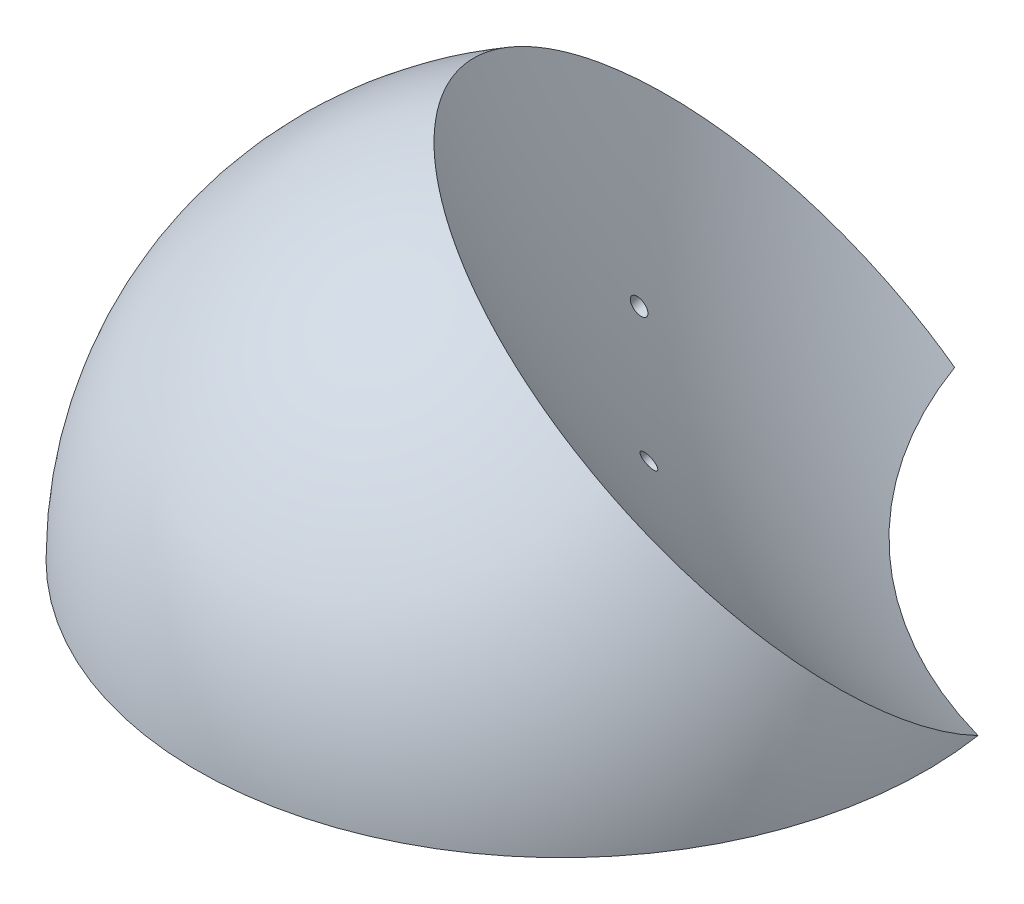
ISO-10303-21;
HEADER;
FILE_DESCRIPTION(('STEP AP214'),'2;1');
FILE_NAME('part.step','',(''),(''),'','','');
FILE_SCHEMA(('AUTOMOTIVE_DESIGN { 1 0 10303 214 1 1 1 1 }'));
ENDSEC;
DATA;
#1=APPLICATION_CONTEXT('core data for automotive mechanical design processes');
#2=APPLICATION_PROTOCOL_DEFINITION('international standard','automotive_design',2000,#1);
#3=PRODUCT_CONTEXT('',#1,'mechanical');
#4=PRODUCT('Part','Part','',(#3));
#5=PRODUCT_RELATED_PRODUCT_CATEGORY('part','',(#4));
#6=PRODUCT_DEFINITION_FORMATION('','',#4);
#7=PRODUCT_DEFINITION_CONTEXT('part definition',#1,'design');
#8=PRODUCT_DEFINITION('design','',#6,#7);
#9=PRODUCT_DEFINITION_SHAPE('','',#8);
#10=(LENGTH_UNIT() NAMED_UNIT(*) SI_UNIT(.MILLI.,.METRE.));
#11=(NAMED_UNIT(*) PLANE_ANGLE_UNIT() SI_UNIT($,.RADIAN.));
#12=(NAMED_UNIT(*) SI_UNIT($,.STERADIAN.) SOLID_ANGLE_UNIT());
#13=UNCERTAINTY_MEASURE_WITH_UNIT(LENGTH_MEASURE(1.E-05),#10,'distance_accuracy_value','');
#14=(GEOMETRIC_REPRESENTATION_CONTEXT(3) GLOBAL_UNCERTAINTY_ASSIGNED_CONTEXT((#13)) GLOBAL_UNIT_ASSIGNED_CONTEXT((#10,
#11,#12)) REPRESENTATION_CONTEXT('',''));
#15=CARTESIAN_POINT('',(0.,0.,0.));
#16=DIRECTION('',(0.,0.,1.));
#17=DIRECTION('',(1.,0.,0.));
#18=AXIS2_PLACEMENT_3D('',#15,#16,#17);
#19=CARTESIAN_POINT('',(-67.4668635926062,-106.5199,73.));
#20=DIRECTION('',(0.,1.,0.));
#21=DIRECTION('',(0.,0.,1.));
#22=AXIS2_PLACEMENT_3D('',#19,#20,#21);
#23=PLANE('',#22);
#24=CARTESIAN_POINT('',(-67.4668635926062,-106.5199,73.));
#25=DIRECTION('',(0.,-1.,0.));
#26=DIRECTION('',(0.,0.,-1.));
#27=AXIS2_PLACEMENT_3D('',#24,#25,#26);
#28=CIRCLE('',#27,50.);
#29=CARTESIAN_POINT('',(-18.0642445552292,-106.5199,65.2940781052911));
#30=VERTEX_POINT('',#29);
#31=CARTESIAN_POINT('',(-63.3893820825484,-106.5199,23.1665358966975));
#32=VERTEX_POINT('',#31);
#33=EDGE_CURVE('E46',#30,#32,#28,.T.);
#34=ORIENTED_EDGE('',*,*,#33,.T.);
#35=CARTESIAN_POINT('',(0.383136407393772,-106.5199,0.));
#36=DIRECTION('',(0.,-1.,0.));
#37=DIRECTION('',(0.,0.,-1.));
#38=AXIS2_PLACEMENT_3D('',#35,#36,#37);
#39=CIRCLE('',#38,67.85);
#40=EDGE_CURVE('E53',#30,#32,#39,.T.);
#41=ORIENTED_EDGE('',*,*,#40,.F.);
#42=EDGE_LOOP('',(#34,#41));
#43=FACE_BOUND('',#42,.T.);
#44=ADVANCED_FACE('F34',(#43),#23,.F.);
#45=CARTESIAN_POINT('',(-67.4668635926062,-106.5199,73.));
#46=DIRECTION('',(0.,-1.,0.));
#47=DIRECTION('',(-1.,0.,0.));
#48=AXIS2_PLACEMENT_3D('',#45,#46,#47);
#49=SPHERICAL_SURFACE('',#48,50.);
#50=ORIENTED_EDGE('',*,*,#33,.F.);
#51=CARTESIAN_POINT('',(-18.0642974977916,-106.5201,65.2937387010644));
#52=CARTESIAN_POINT('',(-17.9852806664305,-106.221613020711,65.8002805778316));
#53=CARTESIAN_POINT('',(-17.9172280459196,-105.917348223661,66.3050507679857));
#54=CARTESIAN_POINT('',(-17.8031443150805,-105.297753250337,67.3102530381507));
#55=CARTESIAN_POINT('',(-17.7571126759161,-104.982423339988,67.8106852220558));
#56=CARTESIAN_POINT('',(-17.6522020748181,-104.020715496859,69.3040611116232));
#57=CARTESIAN_POINT('',(-17.6264663919679,-103.358464277973,70.289347448971));
#58=CARTESIAN_POINT('',(-17.6636627116376,-101.997079056137,72.2313478041603));
#59=CARTESIAN_POINT('',(-17.7265325016335,-101.297971262938,73.1880813882324));
#60=CARTESIAN_POINT('',(-17.8868360815156,-100.225285871343,74.5969429181656));
#61=CARTESIAN_POINT('',(-17.9512744242046,-99.8637047869944,75.0622088485828));
#62=CARTESIAN_POINT('',(-18.1020502012584,-99.1330194175186,75.9833844613894));
#63=CARTESIAN_POINT('',(-18.1883932438485,-98.7639132280404,76.4392917153316));
#64=CARTESIAN_POINT('',(-18.4801125405832,-97.6462084333593,77.7918219560409));
#65=CARTESIAN_POINT('',(-18.7181663894971,-96.8873076608126,78.6731430306269));
#66=CARTESIAN_POINT('',(-19.2796993434425,-95.3477374437189,80.3882863841069));
#67=CARTESIAN_POINT('',(-19.6031784556731,-94.5670679973375,81.2221086589981));
#68=CARTESIAN_POINT('',(-20.1505886321067,-93.3841273363139,82.4325786058128));
#69=CARTESIAN_POINT('',(-20.3434414815659,-92.9877928609099,82.8293875094791));
#70=CARTESIAN_POINT('',(-20.7495196230924,-92.1918584330762,83.6088789427077));
#71=CARTESIAN_POINT('',(-20.9627396845732,-91.7922593430237,83.9915650643866));
#72=CARTESIAN_POINT('',(-21.4092309736387,-90.9903902101936,84.7422440201355));
#73=CARTESIAN_POINT('',(-21.6425040064137,-90.5881199299667,85.1102355270042));
#74=CARTESIAN_POINT('',(-22.1286625947104,-89.7816589240481,85.830840353806));
#75=CARTESIAN_POINT('',(-22.3815494621662,-89.377468071593,86.183452642582));
#76=CARTESIAN_POINT('',(-23.1689742388863,-88.1631031622028,87.2172459360308));
#77=CARTESIAN_POINT('',(-23.7323686990879,-87.350970888294,87.8745386262687));
#78=CARTESIAN_POINT('',(-24.931803102182,-85.7277728729419,89.120264134024));
#79=CARTESIAN_POINT('',(-25.5678431753626,-84.9167071334139,89.7086968280389));
#80=CARTESIAN_POINT('',(-26.9082299405774,-83.3011426857676,90.8127177957361));
#81=CARTESIAN_POINT('',(-27.6125869113507,-82.4966449856582,91.3282950790693));
#82=CARTESIAN_POINT('',(-29.0844934023216,-80.9000947814035,92.2827891517283));
#83=CARTESIAN_POINT('',(-29.8520428852375,-80.1080422699163,92.7217059862809));
#84=CARTESIAN_POINT('',(-31.4447110972299,-78.5421658665004,93.5196716557136));
#85=CARTESIAN_POINT('',(-32.2698176402415,-77.768338162118,93.8787373297822));
#86=CARTESIAN_POINT('',(-33.9718727973684,-76.2442383392648,94.5145519212246));
#87=CARTESIAN_POINT('',(-34.8488214102899,-75.4939662202517,94.7913008404941));
#88=CARTESIAN_POINT('',(-36.6482644157112,-74.0223544852373,95.2604881287252));
#89=CARTESIAN_POINT('',(-37.5707559141909,-73.3010130361041,95.4529318472029));
#90=CARTESIAN_POINT('',(-39.4547718915831,-71.8923379451355,95.7521541518888));
#91=CARTESIAN_POINT('',(-40.4162963610294,-71.2050042950527,95.8589327588726));
#92=CARTESIAN_POINT('',(-42.3713082240171,-69.8693844754449,95.9860395326746));
#93=CARTESIAN_POINT('',(-43.3647881426343,-69.2210892746111,96.0063877709695));
#94=CARTESIAN_POINT('',(-45.3768548821134,-67.9679788248446,95.960533281822));
#95=CARTESIAN_POINT('',(-46.3954417005699,-67.3631635717463,95.8943305626714));
#96=CARTESIAN_POINT('',(-48.4504944422987,-66.2012991228329,95.6758325875251));
#97=CARTESIAN_POINT('',(-49.4869607182589,-65.6442508705607,95.5235356313585));
#98=CARTESIAN_POINT('',(-51.570376004722,-64.5818927951125,95.1339216831798));
#99=CARTESIAN_POINT('',(-52.6173250135875,-64.0765829638542,94.8966047044492));
#100=CARTESIAN_POINT('',(-54.7139730819342,-63.1214212240258,94.3387049417055));
#101=CARTESIAN_POINT('',(-55.7636713317024,-62.6715545306455,94.0181444270825));
#102=CARTESIAN_POINT('',(-57.8586279849242,-61.830318177724,93.2959993146597));
#103=CARTESIAN_POINT('',(-58.9038863891731,-61.4389485077044,92.8944147313733));
#104=CARTESIAN_POINT('',(-60.9825184435381,-60.7174898480723,92.0130738314381));
#105=CARTESIAN_POINT('',(-62.0158921770302,-60.3874004283069,91.5333180635514));
#106=CARTESIAN_POINT('',(-64.0634089378579,-59.7908447932232,90.4990393822191));
#107=CARTESIAN_POINT('',(-65.0775519673363,-59.5243785708157,89.9445164771044));
#108=CARTESIAN_POINT('',(-67.0791853389616,-59.0570111451175,88.764764375248));
#109=CARTESIAN_POINT('',(-68.0666811001275,-58.8560965175914,88.139549690753));
#110=CARTESIAN_POINT('',(-70.0082118776455,-58.5211850165276,86.8227644128879));
#111=CARTESIAN_POINT('',(-70.9622468987583,-58.387188133469,86.1311938289586));
#112=CARTESIAN_POINT('',(-72.8300716871531,-58.1870640907538,84.6866112858119));
#113=CARTESIAN_POINT('',(-73.7438614017701,-58.1209370199092,83.9335992461958));
#114=CARTESIAN_POINT('',(-75.5246952887173,-58.057022796083,82.3714882747145));
#115=CARTESIAN_POINT('',(-76.3917394628366,-58.0592356404859,81.5623893449959));
#116=CARTESIAN_POINT('',(-78.0728243984715,-58.1319815154998,79.8939498028932));
#117=CARTESIAN_POINT('',(-78.8868709577847,-58.2025070594355,79.0346147057987));
#118=CARTESIAN_POINT('',(-80.4562779680151,-58.4113663000296,77.271732940855));
#119=CARTESIAN_POINT('',(-81.21163842443,-58.5496999903358,76.3681862771474));
#120=CARTESIAN_POINT('',(-82.6583038105009,-58.8931924519208,74.5233087900822));
#121=CARTESIAN_POINT('',(-83.3496088701686,-59.0983510875628,73.5819780434196));
#122=CARTESIAN_POINT('',(-84.663253978904,-59.5740361646861,71.6682252928996));
#123=CARTESIAN_POINT('',(-85.2855940254315,-59.8445626085751,70.6958032878971));
#124=CARTESIAN_POINT('',(-86.4568955525227,-60.4490648602593,68.726773817526));
#125=CARTESIAN_POINT('',(-87.0058562765492,-60.7830413221351,67.7301661029292));
#126=CARTESIAN_POINT('',(-88.0264949842677,-61.5120697173853,65.7198628724623));
#127=CARTESIAN_POINT('',(-88.4981729693161,-61.9071216496876,64.7061673568923));
#128=CARTESIAN_POINT('',(-89.3609025679678,-62.7554976485102,62.6688923732876));
#129=CARTESIAN_POINT('',(-89.7519537644886,-63.2088220164542,61.6453128541516));
#130=CARTESIAN_POINT('',(-90.4506551988111,-64.1705223170932,59.5955539302741));
#131=CARTESIAN_POINT('',(-90.7583054267376,-64.6788982563068,58.5693745252247));
#132=CARTESIAN_POINT('',(-91.2880629639534,-65.7471644029332,56.5215743527943));
#133=CARTESIAN_POINT('',(-91.5101587271131,-66.3070615508442,55.4999542190926));
#134=CARTESIAN_POINT('',(-91.86717932888,-67.4743362140084,53.4686774434928));
#135=CARTESIAN_POINT('',(-92.0021041624467,-68.0817137320072,52.4590208022864));
#136=CARTESIAN_POINT('',(-92.1838329233428,-69.339628897505,50.4588631306323));
#137=CARTESIAN_POINT('',(-92.2306379857345,-69.990165988958,49.4683618536088));
#138=CARTESIAN_POINT('',(-92.2358086097921,-71.3297896407367,47.5135432086282));
#139=CARTESIAN_POINT('',(-92.1941741618965,-72.0188762052302,46.549225843502));
#140=CARTESIAN_POINT('',(-92.0227539982137,-73.4308592261215,44.6534268362344));
#141=CARTESIAN_POINT('',(-91.8929494568827,-74.1537628722386,43.7219522511714));
#142=CARTESIAN_POINT('',(-91.5461031029212,-75.6281118309389,41.8986779487401));
#143=CARTESIAN_POINT('',(-91.3290612657668,-76.3795571515456,41.0068782425252));
#144=CARTESIAN_POINT('',(-90.809285718832,-77.9056780981322,39.269267711955));
#145=CARTESIAN_POINT('',(-90.5065494987734,-78.6803544040318,38.4234582356743));
#146=CARTESIAN_POINT('',(-89.8175494597619,-80.2474178251363,36.7838684088315));
#147=CARTESIAN_POINT('',(-89.4312856789861,-81.0398049322463,35.9900880344893));
#148=CARTESIAN_POINT('',(-88.5778764065656,-82.6368695383373,34.4600029900306));
#149=CARTESIAN_POINT('',(-88.1107104801749,-83.4415500955368,33.7237129094924));
#150=CARTESIAN_POINT('',(-87.0988918950084,-85.0572953612574,32.3140632215429));
#151=CARTESIAN_POINT('',(-86.5542390077124,-85.8683600885996,31.6407037997332));
#152=CARTESIAN_POINT('',(-85.3913281877914,-87.4911111709522,30.361705697253));
#153=CARTESIAN_POINT('',(-84.7730705008849,-88.3027975238784,29.756066790521));
#154=CARTESIAN_POINT('',(-83.4673558671628,-89.9210237306316,28.6168174658374));
#155=CARTESIAN_POINT('',(-82.7798997189419,-90.7275636437377,28.0832062168065));
#156=CARTESIAN_POINT('',(-81.3403890437585,-92.3300968939764,27.0915993888036));
#157=CARTESIAN_POINT('',(-80.588309103847,-93.126085938699,26.6336337658479));
#158=CARTESIAN_POINT('',(-79.0250921142726,-94.701578769997,25.7968096268589));
#159=CARTESIAN_POINT('',(-78.2139522509861,-95.4810817688888,25.4179548830097));
#160=CARTESIAN_POINT('',(-76.5386574702371,-97.017807474651,24.7421636461495));
#161=CARTESIAN_POINT('',(-75.6745163363012,-97.7750358990966,24.4452059644547));
#162=CARTESIAN_POINT('',(-73.8992469027619,-99.2619675948406,23.9352271008568));
#163=CARTESIAN_POINT('',(-72.9881273380843,-99.9916759397047,23.7221903783164));
#164=CARTESIAN_POINT('',(-71.3707549057186,-101.230485944107,23.4263705489833));
#165=CARTESIAN_POINT('',(-70.6737236577729,-101.747086162831,23.3240609743076));
#166=CARTESIAN_POINT('',(-69.2604201714549,-102.76054171563,23.1661512038662));
#167=CARTESIAN_POINT('',(-68.5441514138646,-103.257400581848,23.1105426161307));
#168=CARTESIAN_POINT('',(-67.095892716042,-104.228947742047,23.0462788876022));
#169=CARTESIAN_POINT('',(-66.3639219766775,-104.703661085903,23.0375693543322));
#170=CARTESIAN_POINT('',(-64.8861321699355,-105.629814841323,23.066953454164));
#171=CARTESIAN_POINT('',(-64.1403105169883,-106.081250847053,23.1050559140021));
#172=CARTESIAN_POINT('',(-63.389039718202,-106.5201,23.166563911272));
#173=B_SPLINE_CURVE_WITH_KNOTS('',3,(#51,#52,#53,#54,#55,#56,#57,#58,#59,#60,#61,#62,#63,#64,
#65,#66,#67,#68,#69,#70,#71,#72,#73,#74,#75,#76,#77,#78,#79,#80,#81,#82,#83,#84,#85,#86,#87,#88,
#89,#90,#91,#92,#93,#94,#95,#96,#97,#98,#99,#100,#101,#102,#103,#104,#105,#106,#107,#108,#109,
#110,#111,#112,#113,#114,#115,#116,#117,#118,#119,#120,#121,#122,#123,#124,#125,#126,#127,#128,
#129,#130,#131,#132,#133,#134,#135,#136,#137,#138,#139,#140,#141,#142,#143,#144,#145,#146,#147,
#148,#149,#150,#151,#152,#153,#154,#155,#156,#157,#158,#159,#160,#161,#162,#163,#164,#165,#166,
#167,#168,#169,#170,#171,#172),.UNSPECIFIED.,.F.,.F.,(4,2,2,2,2,2,2,2,2,2,2,2,2,2,2,2,2,2,2,2,2,
2,2,2,2,2,2,2,2,2,2,2,2,2,2,2,2,2,2,2,2,2,2,2,2,2,2,2,2,2,2,2,2,2,2,2,2,2,2,2,4),(0.,
1.77942859194961,3.55881444858677,7.1166640849139,10.6720168939067,12.4498392710294,
14.2281172813581,17.7850899057427,21.3420628298836,23.1208279217879,24.8991374236835,
26.6776071789035,28.4561959955239,32.0126402070852,35.5690907971385,39.126077311735,
42.6830617278315,46.2392953264203,49.7955288431172,53.3515366692917,56.90754363306,
60.4627247503627,64.0179055270644,67.5731565131758,71.1284069438993,74.6827072487067,
78.2370069168515,81.7912816348738,85.3455559568664,88.8991019455875,92.452647428721,
96.0061975618939,99.5597475590652,103.11290815184,106.666068411759,110.219221459757,
113.772374638628,117.325564447507,120.87875419402,124.431962320726,127.985170868157,
131.538858776255,135.092546889843,138.646189228405,142.199831951166,145.754233664781,
149.308636377603,152.863143221669,156.417648441118,159.973052791686,163.528467627877,
167.08387059519,170.639232535569,174.195999057594,177.752935135513,181.308950085771,
184.864306216741,187.483563780614,190.1023505742,192.718099502087,195.334341723865),.UNSPECIFIED.);
#174=EDGE_CURVE('E11',#30,#32,#173,.T.);
#175=ORIENTED_EDGE('',*,*,#174,.T.);
#176=EDGE_LOOP('',(#50,#175));
#177=FACE_BOUND('',#176,.T.);
#178=ADVANCED_FACE('F61',(#177),#49,.T.);
#179=CARTESIAN_POINT('',(0.383136407393772,0.,0.));
#180=DIRECTION('',(0.,-1.,0.));
#181=DIRECTION('',(0.,0.,-1.));
#182=AXIS2_PLACEMENT_3D('',#179,#180,#181);
#183=DEGENERATE_TOROIDAL_SURFACE('',#182,0.383136407393772,126.5,.F.);
#184=CARTESIAN_POINT('',(-71.4042526580351,-86.558549837345,57.3227450499507));
#185=CARTESIAN_POINT('',(-71.3464506209463,-86.5863766221148,57.3532879681258));
#186=CARTESIAN_POINT('',(-71.2892662987329,-86.6105029880925,57.3884901394185));
#187=CARTESIAN_POINT('',(-71.1777876383429,-86.6506283361496,57.467234606119));
#188=CARTESIAN_POINT('',(-71.1234968066219,-86.6666176492754,57.5107867393034));
#189=CARTESIAN_POINT('',(-71.0194151767278,-86.6899626434071,57.6049877633849));
#190=CARTESIAN_POINT('',(-70.9696232135994,-86.6973205654083,57.6556348083833));
#191=CARTESIAN_POINT('',(-70.875982479035,-86.7031654703172,57.7625935505348));
#192=CARTESIAN_POINT('',(-70.8321321500521,-86.7016547826734,57.8189037563706));
#193=CARTESIAN_POINT('',(-70.7518121425959,-86.6898036960313,57.9353561281408));
#194=CARTESIAN_POINT('',(-70.7153124035403,-86.6795002009049,57.9954813075537));
#195=CARTESIAN_POINT('',(-70.6505431878305,-86.6503748690552,58.1180603484334));
#196=CARTESIAN_POINT('',(-70.6222737149055,-86.631553028472,58.1805142109553));
#197=CARTESIAN_POINT('',(-70.5749897969883,-86.5860785939078,58.3054799674051));
#198=CARTESIAN_POINT('',(-70.5559081998504,-86.5594851736578,58.367987988213));
#199=CARTESIAN_POINT('',(-70.5272600812022,-86.4991605306766,58.4917267247748));
#200=CARTESIAN_POINT('',(-70.5176931821334,-86.4654295912382,58.5529574911177));
#201=CARTESIAN_POINT('',(-70.5083902491944,-86.3920081302504,58.6720262358199));
#202=CARTESIAN_POINT('',(-70.5085970086304,-86.3523536420011,58.7298819729996));
#203=CARTESIAN_POINT('',(-70.5186948513333,-86.2680709924888,58.8409369386165));
#204=CARTESIAN_POINT('',(-70.5285857572354,-86.2234429223301,58.8941362523163));
#205=CARTESIAN_POINT('',(-70.557733942146,-86.1305694585915,58.9942828643525));
#206=CARTESIAN_POINT('',(-70.5769749603191,-86.0823304675453,59.0412408371459));
#207=CARTESIAN_POINT('',(-70.6242512029941,-85.9835376999951,59.1277013374151));
#208=CARTESIAN_POINT('',(-70.6522865245723,-85.9329838979441,59.1672037825851));
#209=CARTESIAN_POINT('',(-70.7164363404084,-85.8308293577242,59.2377765631656));
#210=CARTESIAN_POINT('',(-70.7525756986446,-85.7792258517198,59.2688202828598));
#211=CARTESIAN_POINT('',(-70.8318400686758,-85.6765753843005,59.3214737522684));
#212=CARTESIAN_POINT('',(-70.874965299025,-85.6255284403511,59.3430832067518));
#213=CARTESIAN_POINT('',(-70.9672776500758,-85.5250800661014,59.3764107921375));
#214=CARTESIAN_POINT('',(-71.0165028073107,-85.4756916803732,59.38806287203));
#215=CARTESIAN_POINT('',(-71.1193888163134,-85.3802918755427,59.4009433447763));
#216=CARTESIAN_POINT('',(-71.1730498456098,-85.3342805917349,59.4021713202416));
#217=CARTESIAN_POINT('',(-71.2836995174714,-85.2465908011758,59.3941689377018));
#218=CARTESIAN_POINT('',(-71.3407093691473,-85.2049459383965,59.3848630844511));
#219=CARTESIAN_POINT('',(-71.4560923141756,-85.127534059184,59.3559515186284));
#220=CARTESIAN_POINT('',(-71.5144654501786,-85.0917672269279,59.3363454834002));
#221=CARTESIAN_POINT('',(-71.6312112317901,-85.0269589394717,59.287273669459));
#222=CARTESIAN_POINT('',(-71.689582571652,-84.9979500629173,59.2577617374467));
#223=CARTESIAN_POINT('',(-71.8043909883956,-84.9477034718313,59.1897314865549));
#224=CARTESIAN_POINT('',(-71.8608280481278,-84.9264658261845,59.1512130878465));
#225=CARTESIAN_POINT('',(-71.9701676463014,-84.8923780240733,59.0662416487889));
#226=CARTESIAN_POINT('',(-72.0230696279293,-84.8795291861559,59.0197873625294));
#227=CARTESIAN_POINT('',(-72.1238050363721,-84.8626171646602,58.9202543470785));
#228=CARTESIAN_POINT('',(-72.1716385585766,-84.8585538157087,58.8671757425995));
#229=CARTESIAN_POINT('',(-72.2606395571373,-84.8593595736502,58.7561513821709));
#230=CARTESIAN_POINT('',(-72.3018361959431,-84.8641883757575,58.6982287180379));
#231=CARTESIAN_POINT('',(-72.3766133810117,-84.8825956637036,58.5789577505752));
#232=CARTESIAN_POINT('',(-72.4101942170148,-84.896173816601,58.5176095776784));
#233=CARTESIAN_POINT('',(-72.468527499348,-84.931589854163,58.3937030711275));
#234=CARTESIAN_POINT('',(-72.4933419557205,-84.9533673759085,58.3311566777365));
#235=CARTESIAN_POINT('',(-72.5337383879157,-85.0045895117464,58.2062221077781));
#236=CARTESIAN_POINT('',(-72.5493207480782,-85.0340338065913,58.1438339247321));
#237=CARTESIAN_POINT('',(-72.5707117388902,-85.0995339732737,58.0214316485935));
#238=CARTESIAN_POINT('',(-72.576585283268,-85.1355441311231,57.9614044289335));
#239=CARTESIAN_POINT('',(-72.5785840580305,-85.2132828147535,57.8450023198843));
#240=CARTESIAN_POINT('',(-72.5747095106349,-85.2550112101598,57.7886273472678));
#241=CARTESIAN_POINT('',(-72.5573546451093,-85.342849319076,57.6813135458397));
#242=CARTESIAN_POINT('',(-72.5439053821277,-85.3889444513334,57.6303577527125));
#243=CARTESIAN_POINT('',(-72.5078314091095,-85.4843166536895,57.5351087617935));
#244=CARTESIAN_POINT('',(-72.4852066620368,-85.5335937366312,57.4908155908958));
#245=CARTESIAN_POINT('',(-72.4313983914,-85.6340162655126,57.4100553101547));
#246=CARTESIAN_POINT('',(-72.40020057845,-85.6851647061028,57.3736014491318));
#247=CARTESIAN_POINT('',(-72.3301695294356,-85.787806633319,57.3096118295207));
#248=CARTESIAN_POINT('',(-72.2913363937373,-85.8393001154007,57.2820759537185));
#249=CARTESIAN_POINT('',(-72.2069060590588,-85.941486029033,57.2365255123624));
#250=CARTESIAN_POINT('',(-72.1612716522162,-85.9921722403597,57.2185659797362));
#251=CARTESIAN_POINT('',(-72.0646918594245,-86.0910397532353,57.192870793015));
#252=CARTESIAN_POINT('',(-72.0137449630427,-86.1392203365232,57.1851380551725));
#253=CARTESIAN_POINT('',(-71.9075739680728,-86.2320911684521,57.1800637651335));
#254=CARTESIAN_POINT('',(-71.852319360157,-86.2767509600435,57.1828044803084));
#255=CARTESIAN_POINT('',(-71.7394898713894,-86.3608747237237,57.1987604442085));
#256=CARTESIAN_POINT('',(-71.6819177315764,-86.4003446112153,57.2119636450915));
#257=CARTESIAN_POINT('',(-71.5874001905175,-86.4596390575845,57.241703127739));
#258=CARTESIAN_POINT('',(-71.550654615012,-86.4813506004926,57.2552285183517));
#259=CARTESIAN_POINT('',(-71.4772753066721,-86.5220469054743,57.2861354186629));
#260=CARTESIAN_POINT('',(-71.4406415742926,-86.5410316564693,57.3035169440274));
#261=CARTESIAN_POINT('',(-71.4042526580351,-86.558549837345,57.3227450499507));
#262=B_SPLINE_CURVE_WITH_KNOTS('',3,(#184,#185,#186,#187,#188,#189,#190,#191,#192,#193,#194,
#195,#196,#197,#198,#199,#200,#201,#202,#203,#204,#205,#206,#207,#208,#209,#210,#211,#212,#213,
#214,#215,#216,#217,#218,#219,#220,#221,#222,#223,#224,#225,#226,#227,#228,#229,#230,#231,#232,
#233,#234,#235,#236,#237,#238,#239,#240,#241,#242,#243,#244,#245,#246,#247,#248,#249,#250,#251,
#252,#253,#254,#255,#256,#257,#258,#259,#260,#261),.UNSPECIFIED.,.T.,.F.,(4,2,2,2,2,2,2,2,2,2,2,
2,2,2,2,2,2,2,2,2,2,2,2,2,2,2,2,2,2,2,2,2,2,2,2,2,2,2,4),(0.,0.212991322102031,0.42623514626411,
0.639423592996876,0.852556045687968,1.06479834511545,1.27704074071348,1.4877074268517,
1.69836575306198,1.90779121792822,2.11721284724612,2.32627156657734,2.53533259369538,
2.74504403630197,2.95476204103788,3.1658606186095,3.37696764867565,3.58959730101236,
3.8022336144313,4.01587471637609,4.22951771200482,4.44319427981393,4.65686682546069,
4.86957325651776,5.08227159387765,5.29343374997767,5.50458711460655,5.71432289871659,
5.92405390168666,6.1331077329643,6.34216240807592,6.55156766654193,6.7609701725666,
6.97156343719338,7.1822167412386,7.39452808312725,7.606595297278,7.74068212684016,
7.87476950115927),.UNSPECIFIED.);
#263=CARTESIAN_POINT('',(-71.4042526580351,-86.558549837345,57.3227450499507));
#264=VERTEX_POINT('',#263);
#265=EDGE_CURVE('E37',#264,#264,#262,.T.);
#266=ORIENTED_EDGE('',*,*,#265,.T.);
#267=EDGE_LOOP('',(#266));
#268=FACE_BOUND('',#267,.T.);
#269=CARTESIAN_POINT('',(-53.051676721484,-86.3223779328516,74.9980491486165));
#270=CARTESIAN_POINT('',(-52.9962367059109,-86.363971159894,74.9898739121474));
#271=CARTESIAN_POINT('',(-52.9381655681922,-86.4030569550349,74.9863500214047));
#272=CARTESIAN_POINT('',(-52.8184372547924,-86.4750647269233,74.9887297354573));
#273=CARTESIAN_POINT('',(-52.7567758664836,-86.5079792635052,74.9946446391708));
#274=CARTESIAN_POINT('',(-52.6317023070364,-86.5666636960706,75.0157267144747));
#275=CARTESIAN_POINT('',(-52.5682912281142,-86.5924379430733,75.0308882334171));
#276=CARTESIAN_POINT('',(-52.4415010807027,-86.6361474644965,75.0700025206379));
#277=CARTESIAN_POINT('',(-52.3781220081952,-86.6540845716669,75.0939532311117));
#278=CARTESIAN_POINT('',(-52.2529675230763,-86.6816948636175,75.150028882923));
#279=CARTESIAN_POINT('',(-52.191197559768,-86.6913428089229,75.1821784059609));
#280=CARTESIAN_POINT('',(-52.0711839540157,-86.7020433543163,75.2536851716736));
#281=CARTESIAN_POINT('',(-52.0129405600236,-86.7030953495051,75.2930429213937));
#282=CARTESIAN_POINT('',(-51.9012042834879,-86.6965826774071,75.3781372695324));
#283=CARTESIAN_POINT('',(-51.8477470554779,-86.6889583449788,75.4239161164074));
#284=CARTESIAN_POINT('',(-51.7475199768524,-86.665238375382,75.5203405265142));
#285=CARTESIAN_POINT('',(-51.7007503826747,-86.6491424134793,75.5709862762433));
#286=CARTESIAN_POINT('',(-51.6148857772098,-86.6088072828666,75.6760881947043));
#287=CARTESIAN_POINT('',(-51.575846718586,-86.5845119585213,75.7305685319637));
#288=CARTESIAN_POINT('',(-51.5069426266286,-86.528501855093,75.8414823455912));
#289=CARTESIAN_POINT('',(-51.4770778345446,-86.4967868809389,75.8979158732779));
#290=CARTESIAN_POINT('',(-51.4272613068593,-86.4266896423469,76.0113764362525));
#291=CARTESIAN_POINT('',(-51.4073498813415,-86.3882811024742,76.0684049451353));
#292=CARTESIAN_POINT('',(-51.3781983835122,-86.3059683790021,76.1812112231871));
#293=CARTESIAN_POINT('',(-51.3689583642649,-86.2620641680764,76.2369889861353));
#294=CARTESIAN_POINT('',(-51.3614407062678,-86.1700337896343,76.345660292113));
#295=CARTESIAN_POINT('',(-51.3631549518514,-86.1219107737612,76.3985559411129));
#296=CARTESIAN_POINT('',(-51.3775136037922,-86.0227804974641,76.4999826930389));
#297=CARTESIAN_POINT('',(-51.3901577517957,-85.971773305241,76.5485138990987));
#298=CARTESIAN_POINT('',(-51.4259584720287,-85.8686059427562,76.6395574325241));
#299=CARTESIAN_POINT('',(-51.4490599076188,-85.8164531678046,76.6820998131843));
#300=CARTESIAN_POINT('',(-51.5051346484058,-85.7122357647558,76.7602172443626));
#301=CARTESIAN_POINT('',(-51.5381075565557,-85.660171133198,76.7957925750118));
#302=CARTESIAN_POINT('',(-51.6127266722057,-85.5580191015428,76.8586872974125));
#303=CARTESIAN_POINT('',(-51.6543069900759,-85.5079199339566,76.8860657519943));
#304=CARTESIAN_POINT('',(-51.7451158917182,-85.4107403845547,76.9321096829732));
#305=CARTESIAN_POINT('',(-51.7943441773805,-85.3636598851755,76.9507754988664));
#306=CARTESIAN_POINT('',(-51.8987125886533,-85.2741631326027,76.9787530282777));
#307=CARTESIAN_POINT('',(-51.9538136795512,-85.2317194653863,76.9881227031431));
#308=CARTESIAN_POINT('',(-52.068609091996,-85.1523724915414,76.9974405141541));
#309=CARTESIAN_POINT('',(-52.1283033212646,-85.1154690736505,76.9973888395297));
#310=CARTESIAN_POINT('',(-52.2504331398835,-85.0483302627173,76.9878845074891));
#311=CARTESIAN_POINT('',(-52.3128618531536,-85.0180791798215,76.9784542666845));
#312=CARTESIAN_POINT('',(-52.4388221321466,-84.9649749201858,76.9505117714537));
#313=CARTESIAN_POINT('',(-52.5023537050407,-84.9421217915684,76.9319994579519));
#314=CARTESIAN_POINT('',(-52.6288891389773,-84.9043866135428,76.8863822404883));
#315=CARTESIAN_POINT('',(-52.6918912627975,-84.889524833919,76.8592557613043));
#316=CARTESIAN_POINT('',(-52.815439155967,-84.868247964075,76.7972165998883));
#317=CARTESIAN_POINT('',(-52.8759848513674,-84.8618331279611,76.7623036834568));
#318=CARTESIAN_POINT('',(-52.9933110284079,-84.8575835842723,76.6854514828596));
#319=CARTESIAN_POINT('',(-53.0500653762338,-84.8598032050643,76.6434693038583));
#320=CARTESIAN_POINT('',(-53.1578138851008,-84.8728504276588,76.5538345723853));
#321=CARTESIAN_POINT('',(-53.2088078223636,-84.8836783637423,76.5061817997722));
#322=CARTESIAN_POINT('',(-53.3039819372541,-84.913725325597,76.406182236282));
#323=CARTESIAN_POINT('',(-53.3481093795187,-84.9330053314317,76.3538035718182));
#324=CARTESIAN_POINT('',(-53.4278721399078,-84.9794090993311,76.2461350377378));
#325=CARTESIAN_POINT('',(-53.463507158177,-85.0065331382824,76.1908450654112));
#326=CARTESIAN_POINT('',(-53.5254541839,-85.0680173613186,76.0786151625016));
#327=CARTESIAN_POINT('',(-53.5517168178691,-85.1024143898892,76.0216681549135));
#328=CARTESIAN_POINT('',(-53.5939120637392,-85.1773875228618,75.9080136061656));
#329=CARTESIAN_POINT('',(-53.6098445329558,-85.2179637126034,75.8513060683242));
#330=CARTESIAN_POINT('',(-53.6309188185988,-85.3041877200219,75.7396966432822));
#331=CARTESIAN_POINT('',(-53.6360520071101,-85.3498395621797,75.6847962342995));
#332=CARTESIAN_POINT('',(-53.6353257294492,-85.4448956623916,75.5784255952888));
#333=CARTESIAN_POINT('',(-53.6294668606068,-85.4942997164031,75.5269551790258));
#334=CARTESIAN_POINT('',(-53.6069353319048,-85.5952456528586,75.4291362491175));
#335=CARTESIAN_POINT('',(-53.5903071586445,-85.6467779276498,75.3827675785769));
#336=CARTESIAN_POINT('',(-53.5467088964142,-85.7507110697205,75.2962516633116));
#337=CARTESIAN_POINT('',(-53.5197365938422,-85.8031121206166,75.2561057528161));
#338=CARTESIAN_POINT('',(-53.4564090164738,-85.9069079801362,75.1834767156434));
#339=CARTESIAN_POINT('',(-53.4201162988122,-85.9583071295866,75.1509451629847));
#340=CARTESIAN_POINT('',(-53.3391028107015,-86.0589272574488,75.094198465302));
#341=CARTESIAN_POINT('',(-53.2943927216852,-86.1081508998291,75.0699728889331));
#342=CARTESIAN_POINT('',(-53.2162326177085,-86.1849489051878,75.0380272221966));
#343=CARTESIAN_POINT('',(-53.184964795457,-86.2136387114873,75.0275336310412));
#344=CARTESIAN_POINT('',(-53.1200336740118,-86.2693389633336,75.0101025813629));
#345=CARTESIAN_POINT('',(-53.0863703844413,-86.2963494156262,75.0031651085549));
#346=CARTESIAN_POINT('',(-53.051676721484,-86.3223779328516,74.9980491486165));
#347=B_SPLINE_CURVE_WITH_KNOTS('',3,(#269,#270,#271,#272,#273,#274,#275,#276,#277,#278,#279,
#280,#281,#282,#283,#284,#285,#286,#287,#288,#289,#290,#291,#292,#293,#294,#295,#296,#297,#298,
#299,#300,#301,#302,#303,#304,#305,#306,#307,#308,#309,#310,#311,#312,#313,#314,#315,#316,#317,
#318,#319,#320,#321,#322,#323,#324,#325,#326,#327,#328,#329,#330,#331,#332,#333,#334,#335,#336,
#337,#338,#339,#340,#341,#342,#343,#344,#345,#346),.UNSPECIFIED.,.T.,.F.,(4,2,2,2,2,2,2,2,2,2,2,
2,2,2,2,2,2,2,2,2,2,2,2,2,2,2,2,2,2,2,2,2,2,2,2,2,2,2,4),(0.,0.209205412656923,
0.418661447215169,0.627989565121118,0.837268704482907,1.04718283725612,1.25711174161136,
1.46849304900835,1.6798824596611,1.89275004479786,2.10562322709655,2.31935167672147,
2.53308118911787,2.74665237447932,2.96021851172621,3.17267149397837,3.38511593216931,
3.59599056301192,3.8068569762445,4.0164002181561,4.22593925134224,4.43497864596067,
4.64401940032282,4.85358790779001,5.06316271948507,5.27405831109514,5.4849620926778,
5.69741321185515,5.90987183126412,6.12343370688349,6.33699853224238,6.55073391715445,
6.76445768760437,6.9773041759032,7.19019623792738,7.40169513638792,7.61292743531822,
7.743846071564,7.87476418189546),.UNSPECIFIED.);
#348=CARTESIAN_POINT('',(-53.051676721484,-86.3223779328516,74.9980491486165));
#349=VERTEX_POINT('',#348);
#350=EDGE_CURVE('E59',#349,#349,#347,.T.);
#351=ORIENTED_EDGE('',*,*,#350,.T.);
#352=EDGE_LOOP('',(#351));
#353=FACE_BOUND('',#352,.T.);
#354=ORIENTED_EDGE('',*,*,#40,.T.);
#355=ORIENTED_EDGE('',*,*,#174,.F.);
#356=EDGE_LOOP('',(#354,#355));
#357=FACE_BOUND('',#356,.T.);
#358=ADVANCED_FACE('F54',(#268,#353,#357),#183,.T.);
#359=CARTESIAN_POINT('',(-56.559492092425,-92.1333543929722,80.3599843916233));
#360=DIRECTION('',(0.465942360113471,0.729100369487046,-0.501308655686036));
#361=DIRECTION('',(0.,0.566568845645556,0.824014407121539));
#362=AXIS2_PLACEMENT_3D('',#359,#360,#361);
#363=CYLINDRICAL_SURFACE('',#362,1.25);
#364=CARTESIAN_POINT('',(-56.559492092425,-92.1333543929722,80.3599843916233));
#365=DIRECTION('',(0.465942360113471,0.729100369487046,-0.501308655686036));
#366=DIRECTION('',(0.,0.566568845645556,0.824014407121539));
#367=AXIS2_PLACEMENT_3D('',#364,#365,#366);
#368=CIRCLE('',#367,1.25);
#369=CARTESIAN_POINT('',(-56.559492092425,-91.4251433359152,81.3900024005252));
#370=VERTEX_POINT('',#369);
#371=EDGE_CURVE('E141',#370,#370,#368,.T.);
#372=ORIENTED_EDGE('',*,*,#371,.F.);
#373=EDGE_LOOP('',(#372));
#374=FACE_BOUND('',#373,.T.);
#375=ORIENTED_EDGE('',*,*,#350,.F.);
#376=EDGE_LOOP('',(#375));
#377=FACE_BOUND('',#376,.T.);
#378=ADVANCED_FACE('F73',(#374,#377),#363,.F.);
#379=CARTESIAN_POINT('',(-56.559492092425,-92.1333543929722,80.3599843916233));
#380=DIRECTION('',(0.465942360113471,0.729100369487046,-0.501308655686036));
#381=DIRECTION('',(0.,0.566568845645556,0.824014407121539));
#382=AXIS2_PLACEMENT_3D('',#379,#380,#381);
#383=PLANE('',#382);
#384=ORIENTED_EDGE('',*,*,#371,.T.);
#385=EDGE_LOOP('',(#384));
#386=FACE_BOUND('',#385,.T.);
#387=ADVANCED_FACE('F80',(#386),#383,.T.);
#388=CARTESIAN_POINT('',(-75.603758280019,-92.1333543929722,62.6592520515176));
#389=DIRECTION('',(0.465942360113471,0.729100369487046,-0.501308655686036));
#390=DIRECTION('',(0.,0.566568845645556,0.824014407121539));
#391=AXIS2_PLACEMENT_3D('',#388,#389,#390);
#392=CYLINDRICAL_SURFACE('',#391,1.25000000000001);
#393=CARTESIAN_POINT('',(-75.603758280019,-92.1333543929722,62.6592520515176));
#394=DIRECTION('',(0.465942360113471,0.729100369487046,-0.501308655686036));
#395=DIRECTION('',(0.,0.566568845645556,0.824014407121539));
#396=AXIS2_PLACEMENT_3D('',#393,#394,#395);
#397=CIRCLE('',#396,1.25000000000001);
#398=CARTESIAN_POINT('',(-75.603758280019,-91.4251433359152,63.6892700604195));
#399=VERTEX_POINT('',#398);
#400=EDGE_CURVE('E138',#399,#399,#397,.T.);
#401=ORIENTED_EDGE('',*,*,#400,.F.);
#402=EDGE_LOOP('',(#401));
#403=FACE_BOUND('',#402,.T.);
#404=ORIENTED_EDGE('',*,*,#265,.F.);
#405=EDGE_LOOP('',(#404));
#406=FACE_BOUND('',#405,.T.);
#407=ADVANCED_FACE('F83',(#403,#406),#392,.F.);
#408=CARTESIAN_POINT('',(-75.603758280019,-92.1333543929722,62.6592520515176));
#409=DIRECTION('',(0.465942360113471,0.729100369487046,-0.501308655686036));
#410=DIRECTION('',(0.,0.566568845645556,0.824014407121539));
#411=AXIS2_PLACEMENT_3D('',#408,#409,#410);
#412=PLANE('',#411);
#413=ORIENTED_EDGE('',*,*,#400,.T.);
#414=EDGE_LOOP('',(#413));
#415=FACE_BOUND('',#414,.T.);
#416=ADVANCED_FACE('F88',(#415),#412,.T.);
#417=CLOSED_SHELL('',(#44,#178,#358,#378,#387,#407,#416));
#418=MANIFOLD_SOLID_BREP('B2',#417);
#419=ADVANCED_BREP_SHAPE_REPRESENTATION('',(#18,#418),#14);
#420=SHAPE_DEFINITION_REPRESENTATION(#9,#419);
ENDSEC;
END-ISO-10303-21;
